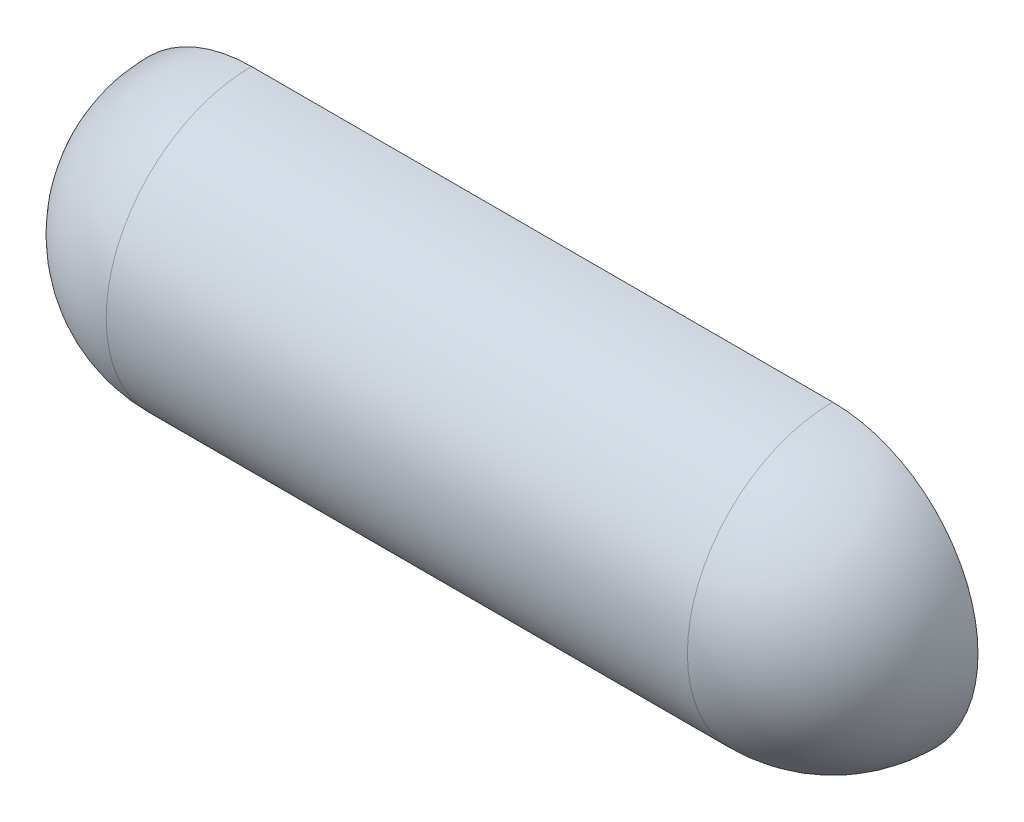
ISO-10303-21;
HEADER;
FILE_DESCRIPTION(('STEP AP214'),'2;1');
FILE_NAME('part.step','',(''),(''),'','','');
FILE_SCHEMA(('AUTOMOTIVE_DESIGN { 1 0 10303 214 1 1 1 1 }'));
ENDSEC;
DATA;
#1=APPLICATION_CONTEXT('core data for automotive mechanical design processes');
#2=APPLICATION_PROTOCOL_DEFINITION('international standard','automotive_design',2000,#1);
#3=PRODUCT_CONTEXT('',#1,'mechanical');
#4=PRODUCT('Part','Part','',(#3));
#5=PRODUCT_RELATED_PRODUCT_CATEGORY('part','',(#4));
#6=PRODUCT_DEFINITION_FORMATION('','',#4);
#7=PRODUCT_DEFINITION_CONTEXT('part definition',#1,'design');
#8=PRODUCT_DEFINITION('design','',#6,#7);
#9=PRODUCT_DEFINITION_SHAPE('','',#8);
#10=(LENGTH_UNIT() NAMED_UNIT(*) SI_UNIT(.MILLI.,.METRE.));
#11=(NAMED_UNIT(*) PLANE_ANGLE_UNIT() SI_UNIT($,.RADIAN.));
#12=(NAMED_UNIT(*) SI_UNIT($,.STERADIAN.) SOLID_ANGLE_UNIT());
#13=UNCERTAINTY_MEASURE_WITH_UNIT(LENGTH_MEASURE(1.E-05),#10,'distance_accuracy_value','');
#14=(GEOMETRIC_REPRESENTATION_CONTEXT(3) GLOBAL_UNCERTAINTY_ASSIGNED_CONTEXT((#13)) GLOBAL_UNIT_ASSIGNED_CONTEXT((#10,
#11,#12)) REPRESENTATION_CONTEXT('',''));
#15=CARTESIAN_POINT('',(0.,0.,0.));
#16=DIRECTION('',(0.,0.,1.));
#17=DIRECTION('',(1.,0.,0.));
#18=AXIS2_PLACEMENT_3D('',#15,#16,#17);
#19=CARTESIAN_POINT('',(0.,0.,0.));
#20=DIRECTION('',(-1.,0.,0.));
#21=DIRECTION('',(0.,-1.,0.));
#22=AXIS2_PLACEMENT_3D('',#19,#20,#21);
#23=SPHERICAL_SURFACE('',#22,75.);
#24=CARTESIAN_POINT('',(0.,0.,0.));
#25=DIRECTION('',(-1.,0.,0.));
#26=DIRECTION('',(0.,0.,1.));
#27=AXIS2_PLACEMENT_3D('',#24,#25,#26);
#28=CIRCLE('',#27,75.);
#29=CARTESIAN_POINT('',(0.,-75.,-5.2372220082647E-13));
#30=VERTEX_POINT('',#29);
#31=CARTESIAN_POINT('',(0.,75.,0.));
#32=VERTEX_POINT('',#31);
#33=EDGE_CURVE('E41',#30,#32,#28,.T.);
#34=ORIENTED_EDGE('',*,*,#33,.T.);
#35=CARTESIAN_POINT('',(0.,0.,0.));
#36=DIRECTION('',(0.,0.,-1.));
#37=DIRECTION('',(1.,0.,0.));
#38=AXIS2_PLACEMENT_3D('',#35,#36,#37);
#39=CIRCLE('',#38,75.);
#40=EDGE_CURVE('E63',#30,#32,#39,.T.);
#41=ORIENTED_EDGE('',*,*,#40,.F.);
#42=EDGE_LOOP('',(#34,#41));
#43=FACE_BOUND('',#42,.T.);
#44=ADVANCED_FACE('F33',(#43),#23,.T.);
#45=CARTESIAN_POINT('',(300.,0.,0.));
#46=DIRECTION('',(-1.,0.,0.));
#47=DIRECTION('',(0.,-1.,0.));
#48=AXIS2_PLACEMENT_3D('',#45,#46,#47);
#49=SPHERICAL_SURFACE('',#48,75.);
#50=CARTESIAN_POINT('',(300.,0.,0.));
#51=DIRECTION('',(-1.,0.,0.));
#52=DIRECTION('',(0.,0.,1.));
#53=AXIS2_PLACEMENT_3D('',#50,#51,#52);
#54=CIRCLE('',#53,75.);
#55=CARTESIAN_POINT('',(300.,-75.,-5.2372220082647E-13));
#56=VERTEX_POINT('',#55);
#57=CARTESIAN_POINT('',(300.,75.,0.));
#58=VERTEX_POINT('',#57);
#59=EDGE_CURVE('E11',#56,#58,#54,.T.);
#60=ORIENTED_EDGE('',*,*,#59,.F.);
#61=CARTESIAN_POINT('',(300.,0.,0.));
#62=DIRECTION('',(0.,0.,-1.));
#63=DIRECTION('',(-1.,0.,0.));
#64=AXIS2_PLACEMENT_3D('',#61,#62,#63);
#65=CIRCLE('',#64,75.);
#66=EDGE_CURVE('E58',#58,#56,#65,.T.);
#67=ORIENTED_EDGE('',*,*,#66,.F.);
#68=EDGE_LOOP('',(#60,#67));
#69=FACE_BOUND('',#68,.T.);
#70=ADVANCED_FACE('F35',(#69),#49,.T.);
#71=CARTESIAN_POINT('',(-75.,0.,0.));
#72=DIRECTION('',(-1.,0.,0.));
#73=DIRECTION('',(0.,0.,1.));
#74=AXIS2_PLACEMENT_3D('',#71,#72,#73);
#75=CYLINDRICAL_SURFACE('',#74,75.);
#76=DIRECTION('',(-1.,0.,0.));
#77=VECTOR('',#76,1.);
#78=CARTESIAN_POINT('',(0.,-75.,-5.2372220082647E-13));
#79=LINE('',#78,#77);
#80=EDGE_CURVE('E62',#56,#30,#79,.T.);
#81=ORIENTED_EDGE('',*,*,#80,.F.);
#82=ORIENTED_EDGE('',*,*,#59,.T.);
#83=DIRECTION('',(-1.,0.,0.));
#84=VECTOR('',#83,1.);
#85=CARTESIAN_POINT('',(0.,75.,0.));
#86=LINE('',#85,#84);
#87=EDGE_CURVE('E66',#58,#32,#86,.T.);
#88=ORIENTED_EDGE('',*,*,#87,.T.);
#89=ORIENTED_EDGE('',*,*,#33,.F.);
#90=EDGE_LOOP('',(#81,#82,#88,#89));
#91=FACE_BOUND('',#90,.T.);
#92=ADVANCED_FACE('F65',(#91),#75,.T.);
#93=CARTESIAN_POINT('',(0.,0.,0.));
#94=DIRECTION('',(0.,0.,-1.));
#95=DIRECTION('',(1.,0.,0.));
#96=AXIS2_PLACEMENT_3D('',#93,#94,#95);
#97=PLANE('',#96);
#98=ORIENTED_EDGE('',*,*,#40,.T.);
#99=ORIENTED_EDGE('',*,*,#87,.F.);
#100=ORIENTED_EDGE('',*,*,#66,.T.);
#101=ORIENTED_EDGE('',*,*,#80,.T.);
#102=EDGE_LOOP('',(#98,#99,#100,#101));
#103=FACE_BOUND('',#102,.T.);
#104=ADVANCED_FACE('F67',(#103),#97,.T.);
#105=CLOSED_SHELL('',(#44,#70,#92,#104));
#106=MANIFOLD_SOLID_BREP('B2',#105);
#107=ADVANCED_BREP_SHAPE_REPRESENTATION('',(#18,#106),#14);
#108=SHAPE_DEFINITION_REPRESENTATION(#9,#107);
ENDSEC;
END-ISO-10303-21;
